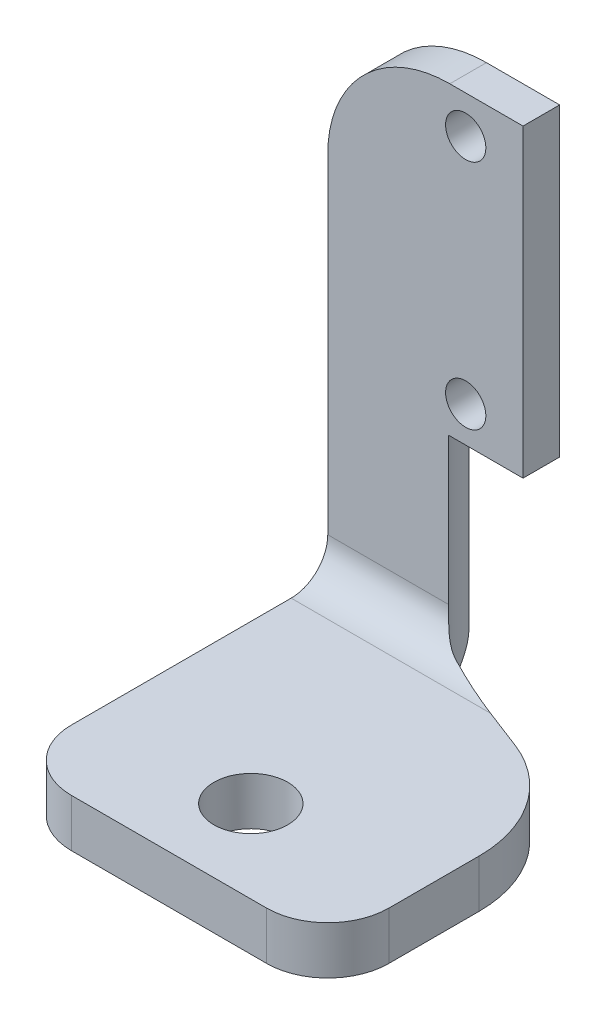
ISO-10303-21;
HEADER;
FILE_DESCRIPTION(('STEP AP214'),'2;1');
FILE_NAME('part.step','',(''),(''),'','','');
FILE_SCHEMA(('AUTOMOTIVE_DESIGN { 1 0 10303 214 1 1 1 1 }'));
ENDSEC;
DATA;
#1=APPLICATION_CONTEXT('core data for automotive mechanical design processes');
#2=APPLICATION_PROTOCOL_DEFINITION('international standard','automotive_design',2000,#1);
#3=PRODUCT_CONTEXT('',#1,'mechanical');
#4=PRODUCT('Part','Part','',(#3));
#5=PRODUCT_RELATED_PRODUCT_CATEGORY('part','',(#4));
#6=PRODUCT_DEFINITION_FORMATION('','',#4);
#7=PRODUCT_DEFINITION_CONTEXT('part definition',#1,'design');
#8=PRODUCT_DEFINITION('design','',#6,#7);
#9=PRODUCT_DEFINITION_SHAPE('','',#8);
#10=(LENGTH_UNIT() NAMED_UNIT(*) SI_UNIT(.MILLI.,.METRE.));
#11=(NAMED_UNIT(*) PLANE_ANGLE_UNIT() SI_UNIT($,.RADIAN.));
#12=(NAMED_UNIT(*) SI_UNIT($,.STERADIAN.) SOLID_ANGLE_UNIT());
#13=UNCERTAINTY_MEASURE_WITH_UNIT(LENGTH_MEASURE(1.E-05),#10,'distance_accuracy_value','');
#14=(GEOMETRIC_REPRESENTATION_CONTEXT(3) GLOBAL_UNCERTAINTY_ASSIGNED_CONTEXT((#13)) GLOBAL_UNIT_ASSIGNED_CONTEXT((#10,
#11,#12)) REPRESENTATION_CONTEXT('',''));
#15=CARTESIAN_POINT('',(0.,0.,0.));
#16=DIRECTION('',(0.,0.,1.));
#17=DIRECTION('',(1.,0.,0.));
#18=AXIS2_PLACEMENT_3D('',#15,#16,#17);
#19=CARTESIAN_POINT('',(-56.,0.,-3.));
#20=DIRECTION('',(-1.,0.,0.));
#21=DIRECTION('',(0.,-1.,0.));
#22=AXIS2_PLACEMENT_3D('',#19,#20,#21);
#23=PLANE('',#22);
#24=DIRECTION('',(0.,0.,-1.));
#25=VECTOR('',#24,1.);
#26=CARTESIAN_POINT('',(-56.,-3.92666866221497,32.));
#27=LINE('',#26,#25);
#28=CARTESIAN_POINT('',(-56.,-3.92666866221497,21.));
#29=VERTEX_POINT('',#28);
#30=CARTESIAN_POINT('',(-56.,-3.92666866221497,0.));
#31=VERTEX_POINT('',#30);
#32=EDGE_CURVE('E205',#29,#31,#27,.T.);
#33=ORIENTED_EDGE('',*,*,#32,.F.);
#34=DIRECTION('',(0.,1.,0.));
#35=VECTOR('',#34,1.);
#36=CARTESIAN_POINT('',(-56.,0.,21.));
#37=LINE('',#36,#35);
#38=CARTESIAN_POINT('',(-56.,0.,21.));
#39=VERTEX_POINT('',#38);
#40=EDGE_CURVE('E11',#29,#39,#37,.T.);
#41=ORIENTED_EDGE('',*,*,#40,.T.);
#42=DIRECTION('',(0.,0.,-1.));
#43=VECTOR('',#42,1.);
#44=CARTESIAN_POINT('',(-56.,0.,32.));
#45=LINE('',#44,#43);
#46=CARTESIAN_POINT('',(-56.,0.,3.));
#47=VERTEX_POINT('',#46);
#48=EDGE_CURVE('E212',#39,#47,#45,.T.);
#49=ORIENTED_EDGE('',*,*,#48,.T.);
#50=CARTESIAN_POINT('',(-56.,3.,3.));
#51=DIRECTION('',(-1.,0.,0.));
#52=DIRECTION('',(0.,-1.,0.));
#53=AXIS2_PLACEMENT_3D('',#50,#51,#52);
#54=CIRCLE('',#53,3.);
#55=CARTESIAN_POINT('',(-56.,3.,0.));
#56=VERTEX_POINT('',#55);
#57=EDGE_CURVE('E379',#47,#56,#54,.F.);
#58=ORIENTED_EDGE('',*,*,#57,.T.);
#59=DIRECTION('',(0.,-1.,0.));
#60=VECTOR('',#59,1.);
#61=CARTESIAN_POINT('',(-56.,0.,0.));
#62=LINE('',#61,#60);
#63=CARTESIAN_POINT('',(-56.0000000000001,30.,0.));
#64=VERTEX_POINT('',#63);
#65=EDGE_CURVE('E177',#64,#56,#62,.T.);
#66=ORIENTED_EDGE('',*,*,#65,.F.);
#67=DIRECTION('',(0.,0.,1.));
#68=VECTOR('',#67,1.);
#69=CARTESIAN_POINT('',(-56.0000000000001,30.,-3.));
#70=LINE('',#69,#68);
#71=CARTESIAN_POINT('',(-56.0000000000001,30.,-3.));
#72=VERTEX_POINT('',#71);
#73=EDGE_CURVE('E390',#64,#72,#70,.F.);
#74=ORIENTED_EDGE('',*,*,#73,.T.);
#75=DIRECTION('',(0.,-1.,0.));
#76=VECTOR('',#75,1.);
#77=CARTESIAN_POINT('',(-56.,0.,-3.));
#78=LINE('',#77,#76);
#79=CARTESIAN_POINT('',(-56.,-0.926668662214968,-3.));
#80=VERTEX_POINT('',#79);
#81=EDGE_CURVE('E190',#72,#80,#78,.T.);
#82=ORIENTED_EDGE('',*,*,#81,.T.);
#83=CARTESIAN_POINT('',(-56.,-0.926668662214968,0.));
#84=DIRECTION('',(-1.,0.,0.));
#85=DIRECTION('',(0.,-1.,0.));
#86=AXIS2_PLACEMENT_3D('',#83,#84,#85);
#87=CIRCLE('',#86,3.);
#88=EDGE_CURVE('E405',#80,#31,#87,.T.);
#89=ORIENTED_EDGE('',*,*,#88,.T.);
#90=EDGE_LOOP('',(#33,#41,#49,#58,#66,#74,#82,#89));
#91=FACE_BOUND('',#90,.T.);
#92=ADVANCED_FACE('F33',(#91),#23,.T.);
#93=CARTESIAN_POINT('',(-40.0000000000001,40.,-3.));
#94=DIRECTION('',(0.,1.,0.));
#95=DIRECTION('',(-1.,0.,0.));
#96=AXIS2_PLACEMENT_3D('',#93,#94,#95);
#97=PLANE('',#96);
#98=DIRECTION('',(-1.,0.,0.));
#99=VECTOR('',#98,1.);
#100=CARTESIAN_POINT('',(-40.0000000000001,40.,-3.));
#101=LINE('',#100,#99);
#102=CARTESIAN_POINT('',(-40.0000000000001,40.,-3.));
#103=VERTEX_POINT('',#102);
#104=CARTESIAN_POINT('',(-46.0000000000001,40.,-3.));
#105=VERTEX_POINT('',#104);
#106=EDGE_CURVE('E194',#103,#105,#101,.T.);
#107=ORIENTED_EDGE('',*,*,#106,.T.);
#108=DIRECTION('',(0.,0.,1.));
#109=VECTOR('',#108,1.);
#110=CARTESIAN_POINT('',(-46.0000000000001,40.,-3.));
#111=LINE('',#110,#109);
#112=CARTESIAN_POINT('',(-46.0000000000001,40.,0.));
#113=VERTEX_POINT('',#112);
#114=EDGE_CURVE('E381',#105,#113,#111,.T.);
#115=ORIENTED_EDGE('',*,*,#114,.T.);
#116=DIRECTION('',(-1.,0.,0.));
#117=VECTOR('',#116,1.);
#118=CARTESIAN_POINT('',(-40.0000000000001,40.,0.));
#119=LINE('',#118,#117);
#120=CARTESIAN_POINT('',(-40.0000000000001,40.,0.));
#121=VERTEX_POINT('',#120);
#122=EDGE_CURVE('E174',#121,#113,#119,.T.);
#123=ORIENTED_EDGE('',*,*,#122,.F.);
#124=DIRECTION('',(0.,0.,1.));
#125=VECTOR('',#124,1.);
#126=CARTESIAN_POINT('',(-40.0000000000001,40.,-3.));
#127=LINE('',#126,#125);
#128=EDGE_CURVE('E172',#103,#121,#127,.T.);
#129=ORIENTED_EDGE('',*,*,#128,.F.);
#130=EDGE_LOOP('',(#107,#115,#123,#129));
#131=FACE_BOUND('',#130,.T.);
#132=ADVANCED_FACE('F290',(#131),#97,.T.);
#133=CARTESIAN_POINT('',(-40.,0.,-3.));
#134=DIRECTION('',(1.,0.,0.));
#135=DIRECTION('',(0.,1.,0.));
#136=AXIS2_PLACEMENT_3D('',#133,#134,#135);
#137=PLANE('',#136);
#138=DIRECTION('',(0.,0.,1.));
#139=VECTOR('',#138,1.);
#140=CARTESIAN_POINT('',(-40.,15.0117609543297,-35.));
#141=LINE('',#140,#139);
#142=CARTESIAN_POINT('',(-40.,15.0117609543297,-3.));
#143=VERTEX_POINT('',#142);
#144=CARTESIAN_POINT('',(-40.,15.0117609543297,0.));
#145=VERTEX_POINT('',#144);
#146=EDGE_CURVE('E148',#143,#145,#141,.T.);
#147=ORIENTED_EDGE('',*,*,#146,.F.);
#148=DIRECTION('',(0.,1.,0.));
#149=VECTOR('',#148,1.);
#150=CARTESIAN_POINT('',(-40.,0.,-3.));
#151=LINE('',#150,#149);
#152=EDGE_CURVE('E197',#143,#103,#151,.T.);
#153=ORIENTED_EDGE('',*,*,#152,.T.);
#154=ORIENTED_EDGE('',*,*,#128,.T.);
#155=DIRECTION('',(0.,1.,0.));
#156=VECTOR('',#155,1.);
#157=CARTESIAN_POINT('',(-40.,0.,0.));
#158=LINE('',#157,#156);
#159=EDGE_CURVE('E164',#145,#121,#158,.T.);
#160=ORIENTED_EDGE('',*,*,#159,.F.);
#161=EDGE_LOOP('',(#147,#153,#154,#160));
#162=FACE_BOUND('',#161,.T.);
#163=ADVANCED_FACE('F170',(#162),#137,.T.);
#164=CARTESIAN_POINT('',(0.,0.,-3.));
#165=DIRECTION('',(0.,0.,-1.));
#166=DIRECTION('',(-1.,0.,0.));
#167=AXIS2_PLACEMENT_3D('',#164,#165,#166);
#168=PLANE('',#167);
#169=DIRECTION('',(0.,1.,0.));
#170=VECTOR('',#169,1.);
#171=CARTESIAN_POINT('',(-47.4403042400917,0.,-3.));
#172=LINE('',#171,#170);
#173=CARTESIAN_POINT('',(-47.4403042400917,-0.926668662214969,-3.));
#174=VERTEX_POINT('',#173);
#175=CARTESIAN_POINT('',(-47.4403042400917,15.0117609543297,-3.));
#176=VERTEX_POINT('',#175);
#177=EDGE_CURVE('E159',#174,#176,#172,.T.);
#178=ORIENTED_EDGE('',*,*,#177,.F.);
#179=DIRECTION('',(-1.,0.,0.));
#180=VECTOR('',#179,1.);
#181=CARTESIAN_POINT('',(0.,-0.926668662214974,-3.));
#182=LINE('',#181,#180);
#183=EDGE_CURVE('E343',#174,#80,#182,.T.);
#184=ORIENTED_EDGE('',*,*,#183,.T.);
#185=ORIENTED_EDGE('',*,*,#81,.F.);
#186=CARTESIAN_POINT('',(-46.0000000000001,30.,-3.));
#187=DIRECTION('',(0.,0.,-1.));
#188=DIRECTION('',(-1.,0.,0.));
#189=AXIS2_PLACEMENT_3D('',#186,#187,#188);
#190=CIRCLE('',#189,10.);
#191=EDGE_CURVE('E392',#72,#105,#190,.T.);
#192=ORIENTED_EDGE('',*,*,#191,.T.);
#193=ORIENTED_EDGE('',*,*,#106,.F.);
#194=ORIENTED_EDGE('',*,*,#152,.F.);
#195=DIRECTION('',(1.,0.,0.));
#196=VECTOR('',#195,1.);
#197=CARTESIAN_POINT('',(0.,15.0117609543297,-3.));
#198=LINE('',#197,#196);
#199=EDGE_CURVE('E155',#176,#143,#198,.T.);
#200=ORIENTED_EDGE('',*,*,#199,.F.);
#201=EDGE_LOOP('',(#178,#184,#185,#192,#193,#194,#200));
#202=FACE_BOUND('',#201,.T.);
#203=CARTESIAN_POINT('',(-44.6972888026245,36.9210568994333,-3.));
#204=DIRECTION('',(0.,0.,1.));
#205=DIRECTION('',(1.,0.,0.));
#206=AXIS2_PLACEMENT_3D('',#203,#204,#205);
#207=CIRCLE('',#206,1.65);
#208=CARTESIAN_POINT('',(-43.0472888026245,36.9210568994333,-3.));
#209=VERTEX_POINT('',#208);
#210=EDGE_CURVE('E200',#209,#209,#207,.T.);
#211=ORIENTED_EDGE('',*,*,#210,.T.);
#212=EDGE_LOOP('',(#211));
#213=FACE_BOUND('',#212,.T.);
#214=CARTESIAN_POINT('',(-44.6972888026245,17.9210568994333,-3.));
#215=DIRECTION('',(0.,0.,1.));
#216=DIRECTION('',(1.,0.,0.));
#217=AXIS2_PLACEMENT_3D('',#214,#215,#216);
#218=CIRCLE('',#217,1.65);
#219=CARTESIAN_POINT('',(-43.0472888026245,17.9210568994333,-3.));
#220=VERTEX_POINT('',#219);
#221=EDGE_CURVE('E175',#220,#220,#218,.T.);
#222=ORIENTED_EDGE('',*,*,#221,.T.);
#223=EDGE_LOOP('',(#222));
#224=FACE_BOUND('',#223,.T.);
#225=ADVANCED_FACE('F301',(#202,#213,#224),#168,.T.);
#226=CARTESIAN_POINT('',(0.,0.,0.));
#227=DIRECTION('',(0.,0.,-1.));
#228=DIRECTION('',(-1.,0.,0.));
#229=AXIS2_PLACEMENT_3D('',#226,#227,#228);
#230=PLANE('',#229);
#231=CARTESIAN_POINT('',(-44.6972888026245,36.9210568994333,0.));
#232=DIRECTION('',(0.,0.,1.));
#233=DIRECTION('',(1.,0.,0.));
#234=AXIS2_PLACEMENT_3D('',#231,#232,#233);
#235=CIRCLE('',#234,1.65);
#236=CARTESIAN_POINT('',(-43.0472888026245,36.9210568994333,0.));
#237=VERTEX_POINT('',#236);
#238=EDGE_CURVE('E202',#237,#237,#235,.T.);
#239=ORIENTED_EDGE('',*,*,#238,.F.);
#240=EDGE_LOOP('',(#239));
#241=FACE_BOUND('',#240,.T.);
#242=CARTESIAN_POINT('',(-44.6972888026245,17.9210568994333,0.));
#243=DIRECTION('',(0.,0.,1.));
#244=DIRECTION('',(1.,0.,0.));
#245=AXIS2_PLACEMENT_3D('',#242,#243,#244);
#246=CIRCLE('',#245,1.65);
#247=CARTESIAN_POINT('',(-43.0472888026245,17.9210568994333,0.));
#248=VERTEX_POINT('',#247);
#249=EDGE_CURVE('E180',#248,#248,#246,.T.);
#250=ORIENTED_EDGE('',*,*,#249,.F.);
#251=EDGE_LOOP('',(#250));
#252=FACE_BOUND('',#251,.T.);
#253=ORIENTED_EDGE('',*,*,#122,.T.);
#254=CARTESIAN_POINT('',(-46.0000000000001,30.,0.));
#255=DIRECTION('',(0.,0.,-1.));
#256=DIRECTION('',(-1.,0.,0.));
#257=AXIS2_PLACEMENT_3D('',#254,#255,#256);
#258=CIRCLE('',#257,10.);
#259=EDGE_CURVE('E384',#113,#64,#258,.F.);
#260=ORIENTED_EDGE('',*,*,#259,.T.);
#261=ORIENTED_EDGE('',*,*,#65,.T.);
#262=DIRECTION('',(1.,0.,0.));
#263=VECTOR('',#262,1.);
#264=CARTESIAN_POINT('',(0.,3.,0.));
#265=LINE('',#264,#263);
#266=CARTESIAN_POINT('',(-46.0900985022477,3.,0.));
#267=VERTEX_POINT('',#266);
#268=EDGE_CURVE('E186',#56,#267,#265,.T.);
#269=ORIENTED_EDGE('',*,*,#268,.T.);
#270=DIRECTION('',(0.,-1.,0.));
#271=VECTOR('',#270,1.);
#272=CARTESIAN_POINT('',(-46.0900985022477,3.,0.));
#273=LINE('',#272,#271);
#274=CARTESIAN_POINT('',(-46.0900985022477,15.0117609543297,0.));
#275=VERTEX_POINT('',#274);
#276=EDGE_CURVE('E167',#267,#275,#273,.F.);
#277=ORIENTED_EDGE('',*,*,#276,.T.);
#278=DIRECTION('',(-1.,0.,0.));
#279=VECTOR('',#278,1.);
#280=CARTESIAN_POINT('',(-40.,15.0117609543297,0.));
#281=LINE('',#280,#279);
#282=EDGE_CURVE('E152',#145,#275,#281,.T.);
#283=ORIENTED_EDGE('',*,*,#282,.F.);
#284=ORIENTED_EDGE('',*,*,#159,.T.);
#285=EDGE_LOOP('',(#253,#260,#261,#269,#277,#283,#284));
#286=FACE_BOUND('',#285,.T.);
#287=ADVANCED_FACE('F163',(#241,#252,#286),#230,.F.);
#288=CARTESIAN_POINT('',(-44.6972888026245,17.9210568994333,-3.));
#289=DIRECTION('',(0.,0.,1.));
#290=DIRECTION('',(1.,0.,0.));
#291=AXIS2_PLACEMENT_3D('',#288,#289,#290);
#292=CYLINDRICAL_SURFACE('',#291,1.65);
#293=ORIENTED_EDGE('',*,*,#221,.F.);
#294=EDGE_LOOP('',(#293));
#295=FACE_BOUND('',#294,.T.);
#296=ORIENTED_EDGE('',*,*,#249,.T.);
#297=EDGE_LOOP('',(#296));
#298=FACE_BOUND('',#297,.T.);
#299=ADVANCED_FACE('F300',(#295,#298),#292,.F.);
#300=CARTESIAN_POINT('',(-44.6972888026245,36.9210568994333,-3.));
#301=DIRECTION('',(0.,0.,1.));
#302=DIRECTION('',(1.,0.,0.));
#303=AXIS2_PLACEMENT_3D('',#300,#301,#302);
#304=CYLINDRICAL_SURFACE('',#303,1.65);
#305=ORIENTED_EDGE('',*,*,#210,.F.);
#306=EDGE_LOOP('',(#305));
#307=FACE_BOUND('',#306,.T.);
#308=ORIENTED_EDGE('',*,*,#238,.T.);
#309=EDGE_LOOP('',(#308));
#310=FACE_BOUND('',#309,.T.);
#311=ADVANCED_FACE('F308',(#307,#310),#304,.F.);
#312=CARTESIAN_POINT('',(-56.,0.,32.));
#313=DIRECTION('',(0.,1.,0.));
#314=DIRECTION('',(-1.,0.,0.));
#315=AXIS2_PLACEMENT_3D('',#312,#313,#314);
#316=PLANE('',#315);
#317=DIRECTION('',(-1.,0.,0.));
#318=VECTOR('',#317,1.);
#319=CARTESIAN_POINT('',(-56.,0.,26.));
#320=LINE('',#319,#318);
#321=CARTESIAN_POINT('',(-35.,0.,26.));
#322=VERTEX_POINT('',#321);
#323=CARTESIAN_POINT('',(-51.,0.,26.));
#324=VERTEX_POINT('',#323);
#325=EDGE_CURVE('E239',#322,#324,#320,.T.);
#326=ORIENTED_EDGE('',*,*,#325,.F.);
#327=CARTESIAN_POINT('',(-35.,0.,21.));
#328=DIRECTION('',(0.,1.,0.));
#329=DIRECTION('',(-1.,0.,0.));
#330=AXIS2_PLACEMENT_3D('',#327,#328,#329);
#331=CIRCLE('',#330,5.);
#332=CARTESIAN_POINT('',(-30.,0.,21.));
#333=VERTEX_POINT('',#332);
#334=EDGE_CURVE('E219',#322,#333,#331,.T.);
#335=ORIENTED_EDGE('',*,*,#334,.T.);
#336=DIRECTION('',(0.,0.,1.));
#337=VECTOR('',#336,1.);
#338=CARTESIAN_POINT('',(-30.,0.,-3.));
#339=LINE('',#338,#337);
#340=CARTESIAN_POINT('',(-30.,0.,13.5880294928334));
#341=VERTEX_POINT('',#340);
#342=EDGE_CURVE('E168',#341,#333,#339,.T.);
#343=ORIENTED_EDGE('',*,*,#342,.F.);
#344=CARTESIAN_POINT('',(-40.,0.,13.5880294928334));
#345=DIRECTION('',(0.,1.,0.));
#346=DIRECTION('',(-1.,0.,0.));
#347=AXIS2_PLACEMENT_3D('',#344,#345,#346);
#348=CIRCLE('',#347,10.);
#349=CARTESIAN_POINT('',(-36.4012033205218,0.,4.25804222275761));
#350=VERTEX_POINT('',#349);
#351=EDGE_CURVE('E401',#341,#350,#348,.T.);
#352=ORIENTED_EDGE('',*,*,#351,.T.);
#353=DIRECTION('',(0.932998727007579,0.,0.359879667947825));
#354=VECTOR('',#353,1.);
#355=CARTESIAN_POINT('',(-47.4403042400917,0.,0.));
#356=LINE('',#355,#354);
#357=CARTESIAN_POINT('',(-39.6627151448708,0.,3.));
#358=VERTEX_POINT('',#357);
#359=EDGE_CURVE('E357',#358,#350,#356,.T.);
#360=ORIENTED_EDGE('',*,*,#359,.F.);
#361=DIRECTION('',(1.,0.,0.));
#362=VECTOR('',#361,1.);
#363=CARTESIAN_POINT('',(-56.,0.,3.));
#364=LINE('',#363,#362);
#365=EDGE_CURVE('E374',#358,#47,#364,.F.);
#366=ORIENTED_EDGE('',*,*,#365,.T.);
#367=ORIENTED_EDGE('',*,*,#48,.F.);
#368=CARTESIAN_POINT('',(-51.,0.,21.));
#369=DIRECTION('',(0.,1.,0.));
#370=DIRECTION('',(-1.,0.,0.));
#371=AXIS2_PLACEMENT_3D('',#368,#369,#370);
#372=CIRCLE('',#371,5.);
#373=EDGE_CURVE('E217',#39,#324,#372,.T.);
#374=ORIENTED_EDGE('',*,*,#373,.T.);
#375=EDGE_LOOP('',(#326,#335,#343,#352,#360,#366,#367,#374));
#376=FACE_BOUND('',#375,.T.);
#377=CARTESIAN_POINT('',(-43.0769344917186,0.,19.2271376874903));
#378=DIRECTION('',(0.,1.,0.));
#379=DIRECTION('',(-1.,0.,0.));
#380=AXIS2_PLACEMENT_3D('',#377,#378,#379);
#381=CIRCLE('',#380,3.025);
#382=CARTESIAN_POINT('',(-46.1019344917186,0.,19.2271376874903));
#383=VERTEX_POINT('',#382);
#384=EDGE_CURVE('E360',#383,#383,#381,.T.);
#385=ORIENTED_EDGE('',*,*,#384,.F.);
#386=EDGE_LOOP('',(#385));
#387=FACE_BOUND('',#386,.T.);
#388=ADVANCED_FACE('F312',(#376,#387),#316,.T.);
#389=CARTESIAN_POINT('',(-56.,-3.92666866221497,32.));
#390=DIRECTION('',(0.,-1.,0.));
#391=DIRECTION('',(1.,0.,0.));
#392=AXIS2_PLACEMENT_3D('',#389,#390,#391);
#393=PLANE('',#392);
#394=DIRECTION('',(0.,0.,-1.));
#395=VECTOR('',#394,1.);
#396=CARTESIAN_POINT('',(-30.,-3.92666866221494,32.));
#397=LINE('',#396,#395);
#398=CARTESIAN_POINT('',(-30.,-3.92666866221494,21.));
#399=VERTEX_POINT('',#398);
#400=CARTESIAN_POINT('',(-30.,-3.92666866221494,13.5880294928334));
#401=VERTEX_POINT('',#400);
#402=EDGE_CURVE('E228',#399,#401,#397,.T.);
#403=ORIENTED_EDGE('',*,*,#402,.F.);
#404=CARTESIAN_POINT('',(-35.,-3.92666866221497,21.));
#405=DIRECTION('',(0.,-1.,0.));
#406=DIRECTION('',(1.,0.,0.));
#407=AXIS2_PLACEMENT_3D('',#404,#405,#406);
#408=CIRCLE('',#407,5.);
#409=CARTESIAN_POINT('',(-35.,-3.92666866221497,26.));
#410=VERTEX_POINT('',#409);
#411=EDGE_CURVE('E41',#399,#410,#408,.T.);
#412=ORIENTED_EDGE('',*,*,#411,.T.);
#413=DIRECTION('',(1.,0.,0.));
#414=VECTOR('',#413,1.);
#415=CARTESIAN_POINT('',(-56.,-3.92666866221497,26.));
#416=LINE('',#415,#414);
#417=CARTESIAN_POINT('',(-51.,-3.92666866221497,26.));
#418=VERTEX_POINT('',#417);
#419=EDGE_CURVE('E226',#418,#410,#416,.T.);
#420=ORIENTED_EDGE('',*,*,#419,.F.);
#421=CARTESIAN_POINT('',(-51.,-3.92666866221497,21.));
#422=DIRECTION('',(0.,-1.,0.));
#423=DIRECTION('',(1.,0.,0.));
#424=AXIS2_PLACEMENT_3D('',#421,#422,#423);
#425=CIRCLE('',#424,5.);
#426=EDGE_CURVE('E48',#418,#29,#425,.T.);
#427=ORIENTED_EDGE('',*,*,#426,.T.);
#428=ORIENTED_EDGE('',*,*,#32,.T.);
#429=DIRECTION('',(-1.,0.,0.));
#430=VECTOR('',#429,1.);
#431=CARTESIAN_POINT('',(-56.,-3.92666866221497,0.));
#432=LINE('',#431,#430);
#433=CARTESIAN_POINT('',(-46.0900985022477,-3.92666866221497,0.));
#434=VERTEX_POINT('',#433);
#435=EDGE_CURVE('E243',#31,#434,#432,.F.);
#436=ORIENTED_EDGE('',*,*,#435,.T.);
#437=CARTESIAN_POINT('',(-42.4595128474725,-3.92666866221497,-3.43785511668844));
#438=DIRECTION('',(0.,-1.,0.));
#439=DIRECTION('',(1.,0.,0.));
#440=AXIS2_PLACEMENT_3D('',#437,#438,#439);
#441=CIRCLE('',#440,5.);
#442=CARTESIAN_POINT('',(-44.2589111872116,-3.92666866221497,1.22713851834945));
#443=VERTEX_POINT('',#442);
#444=EDGE_CURVE('E347',#434,#443,#441,.F.);
#445=ORIENTED_EDGE('',*,*,#444,.T.);
#446=DIRECTION('',(-0.932998727007579,0.,-0.359879667947825));
#447=VECTOR('',#446,1.);
#448=CARTESIAN_POINT('',(-44.1468522034387,-3.92666866221497,1.27036231780749));
#449=LINE('',#448,#447);
#450=CARTESIAN_POINT('',(-36.4012033205217,-3.92666866221497,4.25804222275761));
#451=VERTEX_POINT('',#450);
#452=EDGE_CURVE('E354',#451,#443,#449,.T.);
#453=ORIENTED_EDGE('',*,*,#452,.F.);
#454=CARTESIAN_POINT('',(-40.,-3.92666866221497,13.5880294928334));
#455=DIRECTION('',(0.,-1.,0.));
#456=DIRECTION('',(1.,0.,0.));
#457=AXIS2_PLACEMENT_3D('',#454,#455,#456);
#458=CIRCLE('',#457,10.);
#459=EDGE_CURVE('E397',#451,#401,#458,.T.);
#460=ORIENTED_EDGE('',*,*,#459,.T.);
#461=EDGE_LOOP('',(#403,#412,#420,#427,#428,#436,#445,#453,#460));
#462=FACE_BOUND('',#461,.T.);
#463=CARTESIAN_POINT('',(-43.0769344917186,-3.92666866221497,19.2271376874903));
#464=DIRECTION('',(0.,-1.,0.));
#465=DIRECTION('',(1.,0.,0.));
#466=AXIS2_PLACEMENT_3D('',#463,#464,#465);
#467=CIRCLE('',#466,3.025);
#468=CARTESIAN_POINT('',(-40.0519344917186,-3.92666866221497,19.2271376874903));
#469=VERTEX_POINT('',#468);
#470=EDGE_CURVE('E238',#469,#469,#467,.T.);
#471=ORIENTED_EDGE('',*,*,#470,.F.);
#472=EDGE_LOOP('',(#471));
#473=FACE_BOUND('',#472,.T.);
#474=ADVANCED_FACE('F224',(#462,#473),#393,.T.);
#475=CARTESIAN_POINT('',(-40.,15.0117609543297,-35.));
#476=DIRECTION('',(0.,1.,0.));
#477=DIRECTION('',(0.,0.,1.));
#478=AXIS2_PLACEMENT_3D('',#475,#476,#477);
#479=PLANE('',#478);
#480=ORIENTED_EDGE('',*,*,#282,.T.);
#481=CARTESIAN_POINT('',(-42.4595128474725,15.0117609543297,-3.43785511668844));
#482=DIRECTION('',(0.,1.,0.));
#483=DIRECTION('',(0.,0.,1.));
#484=AXIS2_PLACEMENT_3D('',#481,#482,#483);
#485=CIRCLE('',#484,5.);
#486=EDGE_CURVE('E271',#275,#176,#485,.F.);
#487=ORIENTED_EDGE('',*,*,#486,.T.);
#488=ORIENTED_EDGE('',*,*,#199,.T.);
#489=ORIENTED_EDGE('',*,*,#146,.T.);
#490=EDGE_LOOP('',(#480,#487,#488,#489));
#491=FACE_BOUND('',#490,.T.);
#492=ADVANCED_FACE('F150',(#491),#479,.F.);
#493=CARTESIAN_POINT('',(-30.,-1.06675113723948E-13,0.));
#494=DIRECTION('',(1.,0.,0.));
#495=DIRECTION('',(0.,1.,0.));
#496=AXIS2_PLACEMENT_3D('',#493,#494,#495);
#497=PLANE('',#496);
#498=ORIENTED_EDGE('',*,*,#342,.T.);
#499=DIRECTION('',(0.,1.,0.));
#500=VECTOR('',#499,1.);
#501=CARTESIAN_POINT('',(-30.,-3.92666866221494,21.));
#502=LINE('',#501,#500);
#503=EDGE_CURVE('E56',#333,#399,#502,.F.);
#504=ORIENTED_EDGE('',*,*,#503,.T.);
#505=ORIENTED_EDGE('',*,*,#402,.T.);
#506=DIRECTION('',(0.,-1.,0.));
#507=VECTOR('',#506,1.);
#508=CARTESIAN_POINT('',(-30.,0.,13.5880294928334));
#509=LINE('',#508,#507);
#510=EDGE_CURVE('E399',#401,#341,#509,.F.);
#511=ORIENTED_EDGE('',*,*,#510,.T.);
#512=EDGE_LOOP('',(#498,#504,#505,#511));
#513=FACE_BOUND('',#512,.T.);
#514=ADVANCED_FACE('F321',(#513),#497,.T.);
#515=CARTESIAN_POINT('',(-47.4403042400917,-9.99999999999999,0.));
#516=DIRECTION('',(-0.359879667947825,0.,0.932998727007579));
#517=DIRECTION('',(0.932998727007579,0.,0.359879667947825));
#518=AXIS2_PLACEMENT_3D('',#515,#516,#517);
#519=PLANE('',#518);
#520=ORIENTED_EDGE('',*,*,#452,.T.);
#521=DIRECTION('',(0.,-1.,0.));
#522=VECTOR('',#521,1.);
#523=CARTESIAN_POINT('',(-44.2589111872116,-9.99999999999999,1.22713851834945));
#524=LINE('',#523,#522);
#525=CARTESIAN_POINT('',(-44.2589111872116,0.579883852605453,1.22713851834945));
#526=VERTEX_POINT('',#525);
#527=EDGE_CURVE('E402',#443,#526,#524,.F.);
#528=ORIENTED_EDGE('',*,*,#527,.T.);
#529=CARTESIAN_POINT('',(-39.6627151448708,3.,3.));
#530=DIRECTION('',(-0.359879667947825,0.,0.932998727007579));
#531=DIRECTION('',(0.932998727007579,0.,0.359879667947825));
#532=AXIS2_PLACEMENT_3D('',#529,#530,#531);
#533=ELLIPSE('',#532,8.33611972887264,3.);
#534=EDGE_CURVE('E377',#526,#358,#533,.T.);
#535=ORIENTED_EDGE('',*,*,#534,.T.);
#536=ORIENTED_EDGE('',*,*,#359,.T.);
#537=DIRECTION('',(0.,-1.,0.));
#538=VECTOR('',#537,1.);
#539=CARTESIAN_POINT('',(-36.4012033205217,-3.92666866221496,4.25804222275761));
#540=LINE('',#539,#538);
#541=EDGE_CURVE('E394',#350,#451,#540,.T.);
#542=ORIENTED_EDGE('',*,*,#541,.T.);
#543=EDGE_LOOP('',(#520,#528,#535,#536,#542));
#544=FACE_BOUND('',#543,.T.);
#545=ADVANCED_FACE('F324',(#544),#519,.F.);
#546=CARTESIAN_POINT('',(-43.0769344917186,6.07333133778503,19.2271376874903));
#547=DIRECTION('',(0.,-1.,0.));
#548=DIRECTION('',(1.,0.,0.));
#549=AXIS2_PLACEMENT_3D('',#546,#547,#548);
#550=CYLINDRICAL_SURFACE('',#549,3.025);
#551=ORIENTED_EDGE('',*,*,#384,.T.);
#552=EDGE_LOOP('',(#551));
#553=FACE_BOUND('',#552,.T.);
#554=ORIENTED_EDGE('',*,*,#470,.T.);
#555=EDGE_LOOP('',(#554));
#556=FACE_BOUND('',#555,.T.);
#557=ADVANCED_FACE('F279',(#553,#556),#550,.F.);
#558=CARTESIAN_POINT('',(0.,3.,3.));
#559=DIRECTION('',(1.,0.,0.));
#560=DIRECTION('',(0.,1.,0.));
#561=AXIS2_PLACEMENT_3D('',#558,#559,#560);
#562=CYLINDRICAL_SURFACE('',#561,3.);
#563=ORIENTED_EDGE('',*,*,#57,.F.);
#564=ORIENTED_EDGE('',*,*,#365,.F.);
#565=ORIENTED_EDGE('',*,*,#534,.F.);
#566=CARTESIAN_POINT('',(-44.2589111872116,0.579883852605452,1.22713851834945));
#567=CARTESIAN_POINT('',(-44.3363716825008,0.601776031338024,1.19727860479871));
#568=CARTESIAN_POINT('',(-44.4125822448842,0.625779493459802,1.16564829204322));
#569=CARTESIAN_POINT('',(-44.5620802411227,0.678535357361259,1.09930939973247));
#570=CARTESIAN_POINT('',(-44.6353638869931,0.707293680388166,1.06459700732478));
#571=CARTESIAN_POINT('',(-44.7788455637002,0.770233993312047,0.99240362097619));
#572=CARTESIAN_POINT('',(-44.8490208393259,0.804449523742586,0.954906326583874));
#573=CARTESIAN_POINT('',(-44.9851482093072,0.878609115659147,0.878078279326504));
#574=CARTESIAN_POINT('',(-45.0511025204358,0.918550133914611,0.838748507914424));
#575=CARTESIAN_POINT('',(-45.220716510752,1.03334701080268,0.732437358894314));
#576=CARTESIAN_POINT('',(-45.3201679061059,1.11371611503597,0.664517352154277));
#577=CARTESIAN_POINT('',(-45.5027627863299,1.29233543017025,0.530949882456117));
#578=CARTESIAN_POINT('',(-45.5859590407521,1.39052571529376,0.46529565550155));
#579=CARTESIAN_POINT('',(-45.6974131025383,1.55091759540241,0.37244549667088));
#580=CARTESIAN_POINT('',(-45.7324586919971,1.60682638516624,0.342320515760155));
#581=CARTESIAN_POINT('',(-45.7977847847168,1.72265186776969,0.284755363433177));
#582=CARTESIAN_POINT('',(-45.8280675196341,1.78256666470985,0.25731393691918));
#583=CARTESIAN_POINT('',(-45.883780020618,1.90608898760677,0.205747620099764));
#584=CARTESIAN_POINT('',(-45.9092028710526,1.96970161028551,0.181627469422974));
#585=CARTESIAN_POINT('',(-45.9550623989796,2.09999408999089,0.137358068872766));
#586=CARTESIAN_POINT('',(-45.9755018300864,2.16667222882994,0.117206627257245));
#587=CARTESIAN_POINT('',(-46.0095499641378,2.29558711193883,0.083189537171041));
#588=CARTESIAN_POINT('',(-46.0236427903049,2.35758301863954,0.0688923600603255));
#589=CARTESIAN_POINT('',(-46.047796821731,2.48310992494178,0.0441723465290311));
#590=CARTESIAN_POINT('',(-46.0578584398003,2.54664076665353,0.0337491134103276));
#591=CARTESIAN_POINT('',(-46.0739746458318,2.67487033180263,0.0169689952817721));
#592=CARTESIAN_POINT('',(-46.0800211964368,2.73957113305222,0.0106202674571017));
#593=CARTESIAN_POINT('',(-46.0880831865421,2.86951369537131,0.00212783030510802));
#594=CARTESIAN_POINT('',(-46.0900976157926,2.93475558790098,-1.48251862996359E-05));
#595=CARTESIAN_POINT('',(-46.0900985022477,2.99999999999999,0.));
#596=B_SPLINE_CURVE_WITH_KNOTS('',3,(#566,#567,#568,#569,#570,#571,#572,#573,#574,#575,#576,
#577,#578,#579,#580,#581,#582,#583,#584,#585,#586,#587,#588,#589,#590,#591,#592,#593,#594,#595),
.UNSPECIFIED.,.F.,.F.,(4,2,2,2,2,2,2,2,2,2,2,2,2,2,4),(0.,0.257549816708515,0.515422810868219,
0.774946549579864,1.03433285334905,1.4668093262091,1.89785761888372,2.11519853360962,
2.33243730695074,2.54998294742399,2.76740810810158,2.96265256912642,3.15787703129074,
3.35349112479477,3.54915422336643),.UNSPECIFIED.);
#597=EDGE_CURVE('E263',#526,#267,#596,.T.);
#598=ORIENTED_EDGE('',*,*,#597,.T.);
#599=ORIENTED_EDGE('',*,*,#268,.F.);
#600=EDGE_LOOP('',(#563,#564,#565,#598,#599));
#601=FACE_BOUND('',#600,.T.);
#602=ADVANCED_FACE('F274',(#601),#562,.F.);
#603=CARTESIAN_POINT('',(-46.0000000000001,30.,-3.));
#604=DIRECTION('',(0.,0.,1.));
#605=DIRECTION('',(1.,0.,0.));
#606=AXIS2_PLACEMENT_3D('',#603,#604,#605);
#607=CYLINDRICAL_SURFACE('',#606,10.);
#608=ORIENTED_EDGE('',*,*,#191,.F.);
#609=ORIENTED_EDGE('',*,*,#73,.F.);
#610=ORIENTED_EDGE('',*,*,#259,.F.);
#611=ORIENTED_EDGE('',*,*,#114,.F.);
#612=EDGE_LOOP('',(#608,#609,#610,#611));
#613=FACE_BOUND('',#612,.T.);
#614=ADVANCED_FACE('F278',(#613),#607,.T.);
#615=CARTESIAN_POINT('',(-40.,-9.99999999999995,13.5880294928334));
#616=DIRECTION('',(0.,1.,0.));
#617=DIRECTION('',(-1.,0.,0.));
#618=AXIS2_PLACEMENT_3D('',#615,#616,#617);
#619=CYLINDRICAL_SURFACE('',#618,10.);
#620=ORIENTED_EDGE('',*,*,#351,.F.);
#621=ORIENTED_EDGE('',*,*,#510,.F.);
#622=ORIENTED_EDGE('',*,*,#459,.F.);
#623=ORIENTED_EDGE('',*,*,#541,.F.);
#624=EDGE_LOOP('',(#620,#621,#622,#623));
#625=FACE_BOUND('',#624,.T.);
#626=ADVANCED_FACE('F258',(#625),#619,.T.);
#627=CARTESIAN_POINT('',(-42.4595128474725,0.,-3.43785511668844));
#628=DIRECTION('',(0.,-1.,0.));
#629=DIRECTION('',(0.,0.,-1.));
#630=AXIS2_PLACEMENT_3D('',#627,#628,#629);
#631=CYLINDRICAL_SURFACE('',#630,5.);
#632=ORIENTED_EDGE('',*,*,#444,.F.);
#633=CARTESIAN_POINT('',(-46.0900985022477,-3.92666866221497,0.));
#634=CARTESIAN_POINT('',(-46.1512190945829,-3.92667243921556,-0.0645263155471712));
#635=CARTESIAN_POINT('',(-46.2106218470879,-3.92458628096285,-0.130726077810627));
#636=CARTESIAN_POINT('',(-46.325727240862,-3.91561635633777,-0.266065707368297));
#637=CARTESIAN_POINT('',(-46.3814260864054,-3.90872774899815,-0.335208475181043));
#638=CARTESIAN_POINT('',(-46.4889940845926,-3.8894862692093,-0.476235426625278));
#639=CARTESIAN_POINT('',(-46.5408434072754,-3.87710712409838,-0.548131254002978));
#640=CARTESIAN_POINT('',(-46.640083178369,-3.84631909231885,-0.69366438333623));
#641=CARTESIAN_POINT('',(-46.6874750882528,-3.8279121909329,-0.767301104517832));
#642=CARTESIAN_POINT('',(-46.7778711385736,-3.7844414134007,-0.916068064473663));
#643=CARTESIAN_POINT('',(-46.8208420873541,-3.75933164399402,-0.99120516379956));
#644=CARTESIAN_POINT('',(-46.9018206224649,-3.70217061454053,-1.14151283773049));
#645=CARTESIAN_POINT('',(-46.9398287523458,-3.67012011569818,-1.21668340776323));
#646=CARTESIAN_POINT('',(-47.0107055614072,-3.59901012695948,-1.36579353041789));
#647=CARTESIAN_POINT('',(-47.0435898486699,-3.55997273327293,-1.4397361832022));
#648=CARTESIAN_POINT('',(-47.1044245003466,-3.47483599544788,-1.58554960290539));
#649=CARTESIAN_POINT('',(-47.1323755573639,-3.428737644336,-1.65742065947967));
#650=CARTESIAN_POINT('',(-47.1804675172774,-3.33566072501557,-1.7895470395209));
#651=CARTESIAN_POINT('',(-47.2011438825933,-3.28945977358769,-1.8501574288862));
#652=CARTESIAN_POINT('',(-47.2390839808066,-3.19197393579865,-1.968313973669));
#653=CARTESIAN_POINT('',(-47.2563466184964,-3.14068742576336,-2.02585914137604));
#654=CARTESIAN_POINT('',(-47.2877479267189,-3.03333090163043,-2.13727857800337));
#655=CARTESIAN_POINT('',(-47.3018850402084,-2.9772585225471,-2.19115100807396));
#656=CARTESIAN_POINT('',(-47.3273622922939,-2.86073151836664,-2.29466471895843));
#657=CARTESIAN_POINT('',(-47.3387014091378,-2.80027530280844,-2.34430444978822));
#658=CARTESIAN_POINT('',(-47.3687107368784,-2.61507990301373,-2.48453521117384));
#659=CARTESIAN_POINT('',(-47.383899871133,-2.48459272120976,-2.56843238268548));
#660=CARTESIAN_POINT('',(-47.4075841286391,-2.21176204039592,-2.71524548990598));
#661=CARTESIAN_POINT('',(-47.4160778795068,-2.06941611725285,-2.77815712258826));
#662=CARTESIAN_POINT('',(-47.4258288345188,-1.84331885830599,-2.85778339516816));
#663=CARTESIAN_POINT('',(-47.4286203583775,-1.76236029913975,-2.88249585357998));
#664=CARTESIAN_POINT('',(-47.4331883412418,-1.59859296225527,-2.92500741247845));
#665=CARTESIAN_POINT('',(-47.4349646957534,-1.51578399498101,-2.94280580122175));
#666=CARTESIAN_POINT('',(-47.4377238973461,-1.34889419833465,-2.97134584113907));
#667=CARTESIAN_POINT('',(-47.4387062150987,-1.26481255853856,-2.9820827840567));
#668=CARTESIAN_POINT('',(-47.4399885536055,-1.09604435878921,-2.9964140053312));
#669=CARTESIAN_POINT('',(-47.4402886284446,-1.01135784732121,-3.00000884987607));
#670=CARTESIAN_POINT('',(-47.4403042400917,-0.926668662214969,-3.));
#671=B_SPLINE_CURVE_WITH_KNOTS('',3,(#633,#634,#635,#636,#637,#638,#639,#640,#641,#642,#643,
#644,#645,#646,#647,#648,#649,#650,#651,#652,#653,#654,#655,#656,#657,#658,#659,#660,#661,#662,
#663,#664,#665,#666,#667,#668,#669,#670),.UNSPECIFIED.,.F.,.F.,(4,2,2,2,2,2,2,2,2,2,2,2,2,2,2,2,
2,2,4),(0.,0.266629373039665,0.533527903304297,0.801717579058066,1.0698190134011,
1.33980538576638,1.60976216313835,1.87887981490547,2.14795965366485,2.3845662347061,
2.62124860222172,2.85804861349738,3.09493497013279,3.56035664081884,4.02587368634962,
4.27968453785675,4.53352151006514,4.78752755829635,5.04151346946038),.UNSPECIFIED.);
#672=EDGE_CURVE('E242',#434,#174,#671,.T.);
#673=ORIENTED_EDGE('',*,*,#672,.T.);
#674=ORIENTED_EDGE('',*,*,#177,.T.);
#675=ORIENTED_EDGE('',*,*,#486,.F.);
#676=ORIENTED_EDGE('',*,*,#276,.F.);
#677=ORIENTED_EDGE('',*,*,#597,.F.);
#678=ORIENTED_EDGE('',*,*,#527,.F.);
#679=EDGE_LOOP('',(#632,#673,#674,#675,#676,#677,#678));
#680=FACE_BOUND('',#679,.T.);
#681=ADVANCED_FACE('F254',(#680),#631,.F.);
#682=CARTESIAN_POINT('',(0.,-0.926668662214974,0.));
#683=DIRECTION('',(-1.,0.,0.));
#684=DIRECTION('',(0.,-1.,0.));
#685=AXIS2_PLACEMENT_3D('',#682,#683,#684);
#686=CYLINDRICAL_SURFACE('',#685,3.);
#687=ORIENTED_EDGE('',*,*,#672,.F.);
#688=ORIENTED_EDGE('',*,*,#435,.F.);
#689=ORIENTED_EDGE('',*,*,#88,.F.);
#690=ORIENTED_EDGE('',*,*,#183,.F.);
#691=EDGE_LOOP('',(#687,#688,#689,#690));
#692=FACE_BOUND('',#691,.T.);
#693=ADVANCED_FACE('F252',(#692),#686,.T.);
#694=CARTESIAN_POINT('',(-56.,-9.99999999999999,26.));
#695=DIRECTION('',(0.,0.,-1.));
#696=DIRECTION('',(-1.,0.,0.));
#697=AXIS2_PLACEMENT_3D('',#694,#695,#696);
#698=PLANE('',#697);
#699=ORIENTED_EDGE('',*,*,#419,.T.);
#700=DIRECTION('',(0.,1.,0.));
#701=VECTOR('',#700,1.);
#702=CARTESIAN_POINT('',(-35.,0.,26.));
#703=LINE('',#702,#701);
#704=EDGE_CURVE('E215',#410,#322,#703,.T.);
#705=ORIENTED_EDGE('',*,*,#704,.T.);
#706=ORIENTED_EDGE('',*,*,#325,.T.);
#707=DIRECTION('',(0.,1.,0.));
#708=VECTOR('',#707,1.);
#709=CARTESIAN_POINT('',(-51.,-3.92666866221495,26.));
#710=LINE('',#709,#708);
#711=EDGE_CURVE('E237',#324,#418,#710,.F.);
#712=ORIENTED_EDGE('',*,*,#711,.T.);
#713=EDGE_LOOP('',(#699,#705,#706,#712));
#714=FACE_BOUND('',#713,.T.);
#715=ADVANCED_FACE('F233',(#714),#698,.F.);
#716=CARTESIAN_POINT('',(-35.,-9.99999999999992,21.));
#717=DIRECTION('',(0.,-1.,0.));
#718=DIRECTION('',(1.,0.,0.));
#719=AXIS2_PLACEMENT_3D('',#716,#717,#718);
#720=CYLINDRICAL_SURFACE('',#719,5.);
#721=ORIENTED_EDGE('',*,*,#411,.F.);
#722=ORIENTED_EDGE('',*,*,#503,.F.);
#723=ORIENTED_EDGE('',*,*,#334,.F.);
#724=ORIENTED_EDGE('',*,*,#704,.F.);
#725=EDGE_LOOP('',(#721,#722,#723,#724));
#726=FACE_BOUND('',#725,.T.);
#727=ADVANCED_FACE('F241',(#726),#720,.T.);
#728=CARTESIAN_POINT('',(-51.,0.,21.));
#729=DIRECTION('',(0.,-1.,0.));
#730=DIRECTION('',(1.,0.,0.));
#731=AXIS2_PLACEMENT_3D('',#728,#729,#730);
#732=CYLINDRICAL_SURFACE('',#731,5.);
#733=ORIENTED_EDGE('',*,*,#426,.F.);
#734=ORIENTED_EDGE('',*,*,#711,.F.);
#735=ORIENTED_EDGE('',*,*,#373,.F.);
#736=ORIENTED_EDGE('',*,*,#40,.F.);
#737=EDGE_LOOP('',(#733,#734,#735,#736));
#738=FACE_BOUND('',#737,.T.);
#739=ADVANCED_FACE('F35',(#738),#732,.T.);
#740=CLOSED_SHELL('',(#92,#132,#163,#225,#287,#299,#311,#388,#474,#492,#514,#545,#557,#602,#614,
#626,#681,#693,#715,#727,#739));
#741=MANIFOLD_SOLID_BREP('B2',#740);
#742=ADVANCED_BREP_SHAPE_REPRESENTATION('',(#18,#741),#14);
#743=SHAPE_DEFINITION_REPRESENTATION(#9,#742);
ENDSEC;
END-ISO-10303-21;
